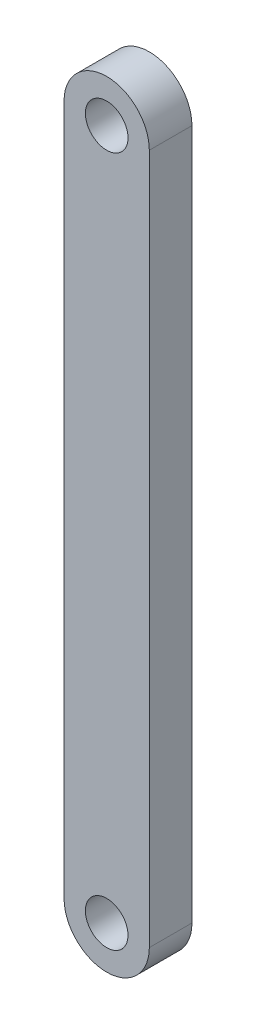
ISO-10303-21;
HEADER;
FILE_DESCRIPTION(('STEP AP214'),'2;1');
FILE_NAME('part.step','',(''),(''),'','','');
FILE_SCHEMA(('AUTOMOTIVE_DESIGN { 1 0 10303 214 1 1 1 1 }'));
ENDSEC;
DATA;
#1=APPLICATION_CONTEXT('core data for automotive mechanical design processes');
#2=APPLICATION_PROTOCOL_DEFINITION('international standard','automotive_design',2000,#1);
#3=PRODUCT_CONTEXT('',#1,'mechanical');
#4=PRODUCT('Part','Part','',(#3));
#5=PRODUCT_RELATED_PRODUCT_CATEGORY('part','',(#4));
#6=PRODUCT_DEFINITION_FORMATION('','',#4);
#7=PRODUCT_DEFINITION_CONTEXT('part definition',#1,'design');
#8=PRODUCT_DEFINITION('design','',#6,#7);
#9=PRODUCT_DEFINITION_SHAPE('','',#8);
#10=(LENGTH_UNIT() NAMED_UNIT(*) SI_UNIT(.MILLI.,.METRE.));
#11=(NAMED_UNIT(*) PLANE_ANGLE_UNIT() SI_UNIT($,.RADIAN.));
#12=(NAMED_UNIT(*) SI_UNIT($,.STERADIAN.) SOLID_ANGLE_UNIT());
#13=UNCERTAINTY_MEASURE_WITH_UNIT(LENGTH_MEASURE(1.E-05),#10,'distance_accuracy_value','');
#14=(GEOMETRIC_REPRESENTATION_CONTEXT(3) GLOBAL_UNCERTAINTY_ASSIGNED_CONTEXT((#13)) GLOBAL_UNIT_ASSIGNED_CONTEXT((#10,
#11,#12)) REPRESENTATION_CONTEXT('',''));
#15=CARTESIAN_POINT('',(0.,0.,0.));
#16=DIRECTION('',(0.,0.,1.));
#17=DIRECTION('',(1.,0.,0.));
#18=AXIS2_PLACEMENT_3D('',#15,#16,#17);
#19=CARTESIAN_POINT('',(0.,102.87,6.35));
#20=DIRECTION('',(0.,0.,1.));
#21=DIRECTION('',(1.,0.,0.));
#22=AXIS2_PLACEMENT_3D('',#19,#20,#21);
#23=PLANE('',#22);
#24=CARTESIAN_POINT('',(0.,102.87,6.35));
#25=DIRECTION('',(0.,0.,1.));
#26=DIRECTION('',(1.,0.,0.));
#27=AXIS2_PLACEMENT_3D('',#24,#25,#26);
#28=CIRCLE('',#27,3.175);
#29=CARTESIAN_POINT('',(3.175,102.87,6.35));
#30=VERTEX_POINT('',#29);
#31=EDGE_CURVE('E116',#30,#30,#28,.T.);
#32=ORIENTED_EDGE('',*,*,#31,.F.);
#33=EDGE_LOOP('',(#32));
#34=FACE_BOUND('',#33,.T.);
#35=CARTESIAN_POINT('',(0.,102.87,6.35));
#36=DIRECTION('',(0.,0.,1.));
#37=DIRECTION('',(1.,0.,0.));
#38=AXIS2_PLACEMENT_3D('',#35,#36,#37);
#39=CIRCLE('',#38,6.35);
#40=CARTESIAN_POINT('',(6.35,102.87,6.35));
#41=VERTEX_POINT('',#40);
#42=CARTESIAN_POINT('',(-6.35,102.87,6.35));
#43=VERTEX_POINT('',#42);
#44=EDGE_CURVE('E96',#41,#43,#39,.T.);
#45=ORIENTED_EDGE('',*,*,#44,.T.);
#46=DIRECTION('',(0.,-1.,0.));
#47=VECTOR('',#46,1.);
#48=CARTESIAN_POINT('',(-6.35,102.87,6.35));
#49=LINE('',#48,#47);
#50=CARTESIAN_POINT('',(-6.35,0.,6.35));
#51=VERTEX_POINT('',#50);
#52=EDGE_CURVE('E91',#43,#51,#49,.T.);
#53=ORIENTED_EDGE('',*,*,#52,.T.);
#54=CARTESIAN_POINT('',(0.,0.,6.35));
#55=DIRECTION('',(0.,0.,1.));
#56=DIRECTION('',(1.,0.,0.));
#57=AXIS2_PLACEMENT_3D('',#54,#55,#56);
#58=CIRCLE('',#57,6.35);
#59=CARTESIAN_POINT('',(6.35,0.,6.35));
#60=VERTEX_POINT('',#59);
#61=EDGE_CURVE('E94',#51,#60,#58,.T.);
#62=ORIENTED_EDGE('',*,*,#61,.T.);
#63=DIRECTION('',(0.,1.,0.));
#64=VECTOR('',#63,1.);
#65=CARTESIAN_POINT('',(6.35,102.87,6.35));
#66=LINE('',#65,#64);
#67=EDGE_CURVE('E61',#60,#41,#66,.T.);
#68=ORIENTED_EDGE('',*,*,#67,.T.);
#69=EDGE_LOOP('',(#45,#53,#62,#68));
#70=FACE_BOUND('',#69,.T.);
#71=CARTESIAN_POINT('',(0.,0.,6.35));
#72=DIRECTION('',(0.,0.,1.));
#73=DIRECTION('',(1.,0.,0.));
#74=AXIS2_PLACEMENT_3D('',#71,#72,#73);
#75=CIRCLE('',#74,3.175);
#76=CARTESIAN_POINT('',(3.175,0.,6.35));
#77=VERTEX_POINT('',#76);
#78=EDGE_CURVE('E138',#77,#77,#75,.T.);
#79=ORIENTED_EDGE('',*,*,#78,.F.);
#80=EDGE_LOOP('',(#79));
#81=FACE_BOUND('',#80,.T.);
#82=ADVANCED_FACE('F43',(#34,#70,#81),#23,.T.);
#83=CARTESIAN_POINT('',(0.,102.87,0.));
#84=DIRECTION('',(0.,0.,1.));
#85=DIRECTION('',(1.,0.,0.));
#86=AXIS2_PLACEMENT_3D('',#83,#84,#85);
#87=PLANE('',#86);
#88=CARTESIAN_POINT('',(0.,102.87,0.));
#89=DIRECTION('',(0.,0.,1.));
#90=DIRECTION('',(1.,0.,0.));
#91=AXIS2_PLACEMENT_3D('',#88,#89,#90);
#92=CIRCLE('',#91,6.35);
#93=CARTESIAN_POINT('',(6.35,102.87,0.));
#94=VERTEX_POINT('',#93);
#95=CARTESIAN_POINT('',(-6.35,102.87,0.));
#96=VERTEX_POINT('',#95);
#97=EDGE_CURVE('E112',#94,#96,#92,.T.);
#98=ORIENTED_EDGE('',*,*,#97,.F.);
#99=DIRECTION('',(0.,1.,0.));
#100=VECTOR('',#99,1.);
#101=CARTESIAN_POINT('',(6.35,102.87,0.));
#102=LINE('',#101,#100);
#103=CARTESIAN_POINT('',(6.35,0.,0.));
#104=VERTEX_POINT('',#103);
#105=EDGE_CURVE('E84',#104,#94,#102,.T.);
#106=ORIENTED_EDGE('',*,*,#105,.F.);
#107=CARTESIAN_POINT('',(0.,0.,0.));
#108=DIRECTION('',(0.,0.,1.));
#109=DIRECTION('',(1.,0.,0.));
#110=AXIS2_PLACEMENT_3D('',#107,#108,#109);
#111=CIRCLE('',#110,6.35);
#112=CARTESIAN_POINT('',(-6.35,0.,0.));
#113=VERTEX_POINT('',#112);
#114=EDGE_CURVE('E78',#113,#104,#111,.T.);
#115=ORIENTED_EDGE('',*,*,#114,.F.);
#116=DIRECTION('',(0.,-1.,0.));
#117=VECTOR('',#116,1.);
#118=CARTESIAN_POINT('',(-6.35,102.87,0.));
#119=LINE('',#118,#117);
#120=EDGE_CURVE('E101',#96,#113,#119,.T.);
#121=ORIENTED_EDGE('',*,*,#120,.F.);
#122=EDGE_LOOP('',(#98,#106,#115,#121));
#123=FACE_BOUND('',#122,.T.);
#124=CARTESIAN_POINT('',(0.,102.87,0.));
#125=DIRECTION('',(0.,0.,1.));
#126=DIRECTION('',(1.,0.,0.));
#127=AXIS2_PLACEMENT_3D('',#124,#125,#126);
#128=CIRCLE('',#127,3.175);
#129=CARTESIAN_POINT('',(3.175,102.87,0.));
#130=VERTEX_POINT('',#129);
#131=EDGE_CURVE('E134',#130,#130,#128,.T.);
#132=ORIENTED_EDGE('',*,*,#131,.T.);
#133=EDGE_LOOP('',(#132));
#134=FACE_BOUND('',#133,.T.);
#135=CARTESIAN_POINT('',(0.,0.,0.));
#136=DIRECTION('',(0.,0.,1.));
#137=DIRECTION('',(1.,0.,0.));
#138=AXIS2_PLACEMENT_3D('',#135,#136,#137);
#139=CIRCLE('',#138,3.175);
#140=CARTESIAN_POINT('',(3.175,0.,0.));
#141=VERTEX_POINT('',#140);
#142=EDGE_CURVE('E142',#141,#141,#139,.T.);
#143=ORIENTED_EDGE('',*,*,#142,.T.);
#144=EDGE_LOOP('',(#143));
#145=FACE_BOUND('',#144,.T.);
#146=ADVANCED_FACE('F129',(#123,#134,#145),#87,.F.);
#147=CARTESIAN_POINT('',(0.,102.87,6.35));
#148=DIRECTION('',(0.,0.,-1.));
#149=DIRECTION('',(-1.,0.,0.));
#150=AXIS2_PLACEMENT_3D('',#147,#148,#149);
#151=CYLINDRICAL_SURFACE('',#150,6.35);
#152=ORIENTED_EDGE('',*,*,#97,.T.);
#153=DIRECTION('',(0.,0.,-1.));
#154=VECTOR('',#153,1.);
#155=CARTESIAN_POINT('',(-6.35,102.87,6.35));
#156=LINE('',#155,#154);
#157=EDGE_CURVE('E11',#43,#96,#156,.T.);
#158=ORIENTED_EDGE('',*,*,#157,.F.);
#159=ORIENTED_EDGE('',*,*,#44,.F.);
#160=DIRECTION('',(0.,0.,-1.));
#161=VECTOR('',#160,1.);
#162=CARTESIAN_POINT('',(6.35,102.87,6.35));
#163=LINE('',#162,#161);
#164=EDGE_CURVE('E108',#41,#94,#163,.T.);
#165=ORIENTED_EDGE('',*,*,#164,.T.);
#166=EDGE_LOOP('',(#152,#158,#159,#165));
#167=FACE_BOUND('',#166,.T.);
#168=ADVANCED_FACE('F45',(#167),#151,.T.);
#169=CARTESIAN_POINT('',(-6.35,102.87,6.35));
#170=DIRECTION('',(1.,0.,0.));
#171=DIRECTION('',(0.,1.,0.));
#172=AXIS2_PLACEMENT_3D('',#169,#170,#171);
#173=PLANE('',#172);
#174=ORIENTED_EDGE('',*,*,#120,.T.);
#175=DIRECTION('',(0.,0.,-1.));
#176=VECTOR('',#175,1.);
#177=CARTESIAN_POINT('',(-6.35,0.,6.35));
#178=LINE('',#177,#176);
#179=EDGE_CURVE('E53',#51,#113,#178,.T.);
#180=ORIENTED_EDGE('',*,*,#179,.F.);
#181=ORIENTED_EDGE('',*,*,#52,.F.);
#182=ORIENTED_EDGE('',*,*,#157,.T.);
#183=EDGE_LOOP('',(#174,#180,#181,#182));
#184=FACE_BOUND('',#183,.T.);
#185=ADVANCED_FACE('F100',(#184),#173,.F.);
#186=CARTESIAN_POINT('',(0.,0.,6.35));
#187=DIRECTION('',(0.,0.,-1.));
#188=DIRECTION('',(-1.,0.,0.));
#189=AXIS2_PLACEMENT_3D('',#186,#187,#188);
#190=CYLINDRICAL_SURFACE('',#189,6.35);
#191=ORIENTED_EDGE('',*,*,#114,.T.);
#192=DIRECTION('',(0.,0.,-1.));
#193=VECTOR('',#192,1.);
#194=CARTESIAN_POINT('',(6.35,0.,6.35));
#195=LINE('',#194,#193);
#196=EDGE_CURVE('E103',#60,#104,#195,.T.);
#197=ORIENTED_EDGE('',*,*,#196,.F.);
#198=ORIENTED_EDGE('',*,*,#61,.F.);
#199=ORIENTED_EDGE('',*,*,#179,.T.);
#200=EDGE_LOOP('',(#191,#197,#198,#199));
#201=FACE_BOUND('',#200,.T.);
#202=ADVANCED_FACE('F104',(#201),#190,.T.);
#203=CARTESIAN_POINT('',(6.35,102.87,6.35));
#204=DIRECTION('',(-1.,0.,0.));
#205=DIRECTION('',(0.,-1.,0.));
#206=AXIS2_PLACEMENT_3D('',#203,#204,#205);
#207=PLANE('',#206);
#208=ORIENTED_EDGE('',*,*,#105,.T.);
#209=ORIENTED_EDGE('',*,*,#164,.F.);
#210=ORIENTED_EDGE('',*,*,#67,.F.);
#211=ORIENTED_EDGE('',*,*,#196,.T.);
#212=EDGE_LOOP('',(#208,#209,#210,#211));
#213=FACE_BOUND('',#212,.T.);
#214=ADVANCED_FACE('F126',(#213),#207,.F.);
#215=CARTESIAN_POINT('',(0.,102.87,6.35));
#216=DIRECTION('',(0.,0.,-1.));
#217=DIRECTION('',(-1.,0.,0.));
#218=AXIS2_PLACEMENT_3D('',#215,#216,#217);
#219=CYLINDRICAL_SURFACE('',#218,3.175);
#220=ORIENTED_EDGE('',*,*,#31,.T.);
#221=EDGE_LOOP('',(#220));
#222=FACE_BOUND('',#221,.T.);
#223=ORIENTED_EDGE('',*,*,#131,.F.);
#224=EDGE_LOOP('',(#223));
#225=FACE_BOUND('',#224,.T.);
#226=ADVANCED_FACE('F161',(#222,#225),#219,.F.);
#227=CARTESIAN_POINT('',(0.,0.,6.35));
#228=DIRECTION('',(0.,0.,-1.));
#229=DIRECTION('',(-1.,0.,0.));
#230=AXIS2_PLACEMENT_3D('',#227,#228,#229);
#231=CYLINDRICAL_SURFACE('',#230,3.175);
#232=ORIENTED_EDGE('',*,*,#78,.T.);
#233=EDGE_LOOP('',(#232));
#234=FACE_BOUND('',#233,.T.);
#235=ORIENTED_EDGE('',*,*,#142,.F.);
#236=EDGE_LOOP('',(#235));
#237=FACE_BOUND('',#236,.T.);
#238=ADVANCED_FACE('F150',(#234,#237),#231,.F.);
#239=CLOSED_SHELL('',(#82,#146,#168,#185,#202,#214,#226,#238));
#240=MANIFOLD_SOLID_BREP('B2',#239);
#241=ADVANCED_BREP_SHAPE_REPRESENTATION('',(#18,#240),#14);
#242=SHAPE_DEFINITION_REPRESENTATION(#9,#241);
ENDSEC;
END-ISO-10303-21;
